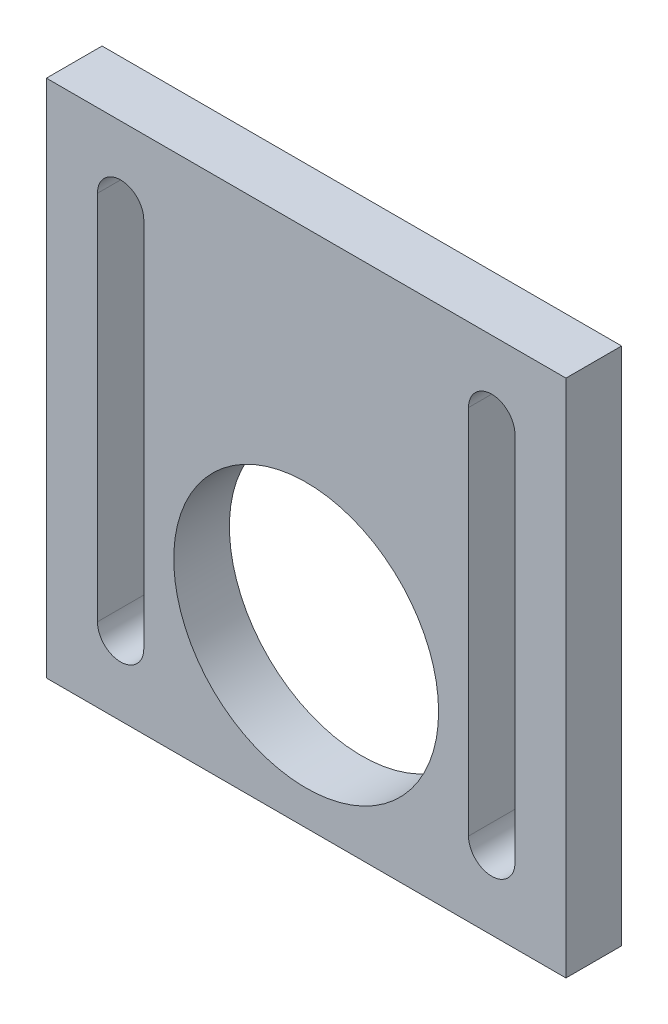
ISO-10303-21;
HEADER;
FILE_DESCRIPTION(('STEP AP214'),'2;1');
FILE_NAME('part.step','',(''),(''),'','','');
FILE_SCHEMA(('AUTOMOTIVE_DESIGN { 1 0 10303 214 1 1 1 1 }'));
ENDSEC;
DATA;
#1=APPLICATION_CONTEXT('core data for automotive mechanical design processes');
#2=APPLICATION_PROTOCOL_DEFINITION('international standard','automotive_design',2000,#1);
#3=PRODUCT_CONTEXT('',#1,'mechanical');
#4=PRODUCT('Part','Part','',(#3));
#5=PRODUCT_RELATED_PRODUCT_CATEGORY('part','',(#4));
#6=PRODUCT_DEFINITION_FORMATION('','',#4);
#7=PRODUCT_DEFINITION_CONTEXT('part definition',#1,'design');
#8=PRODUCT_DEFINITION('design','',#6,#7);
#9=PRODUCT_DEFINITION_SHAPE('','',#8);
#10=(LENGTH_UNIT() NAMED_UNIT(*) SI_UNIT(.MILLI.,.METRE.));
#11=(NAMED_UNIT(*) PLANE_ANGLE_UNIT() SI_UNIT($,.RADIAN.));
#12=(NAMED_UNIT(*) SI_UNIT($,.STERADIAN.) SOLID_ANGLE_UNIT());
#13=UNCERTAINTY_MEASURE_WITH_UNIT(LENGTH_MEASURE(1.E-05),#10,'distance_accuracy_value','');
#14=(GEOMETRIC_REPRESENTATION_CONTEXT(3) GLOBAL_UNCERTAINTY_ASSIGNED_CONTEXT((#13)) GLOBAL_UNIT_ASSIGNED_CONTEXT((#10,
#11,#12)) REPRESENTATION_CONTEXT('',''));
#15=CARTESIAN_POINT('',(0.,0.,0.));
#16=DIRECTION('',(0.,0.,1.));
#17=DIRECTION('',(1.,0.,0.));
#18=AXIS2_PLACEMENT_3D('',#15,#16,#17);
#19=CARTESIAN_POINT('',(0.,0.,6.));
#20=DIRECTION('',(-1.,0.,0.));
#21=DIRECTION('',(0.,0.,1.));
#22=AXIS2_PLACEMENT_3D('',#19,#20,#21);
#23=PLANE('',#22);
#24=DIRECTION('',(0.,1.,0.));
#25=VECTOR('',#24,1.);
#26=CARTESIAN_POINT('',(0.,0.,0.));
#27=LINE('',#26,#25);
#28=CARTESIAN_POINT('',(0.,0.,0.));
#29=VERTEX_POINT('',#28);
#30=CARTESIAN_POINT('',(0.,56.,0.));
#31=VERTEX_POINT('',#30);
#32=EDGE_CURVE('E196',#29,#31,#27,.T.);
#33=ORIENTED_EDGE('',*,*,#32,.F.);
#34=DIRECTION('',(0.,0.,-1.));
#35=VECTOR('',#34,1.);
#36=CARTESIAN_POINT('',(0.,0.,6.));
#37=LINE('',#36,#35);
#38=CARTESIAN_POINT('',(0.,0.,6.));
#39=VERTEX_POINT('',#38);
#40=EDGE_CURVE('E11',#39,#29,#37,.T.);
#41=ORIENTED_EDGE('',*,*,#40,.F.);
#42=DIRECTION('',(0.,1.,0.));
#43=VECTOR('',#42,1.);
#44=CARTESIAN_POINT('',(0.,0.,6.));
#45=LINE('',#44,#43);
#46=CARTESIAN_POINT('',(0.,56.,6.));
#47=VERTEX_POINT('',#46);
#48=EDGE_CURVE('E199',#39,#47,#45,.T.);
#49=ORIENTED_EDGE('',*,*,#48,.T.);
#50=DIRECTION('',(0.,0.,-1.));
#51=VECTOR('',#50,1.);
#52=CARTESIAN_POINT('',(0.,56.,6.));
#53=LINE('',#52,#51);
#54=EDGE_CURVE('E45',#47,#31,#53,.T.);
#55=ORIENTED_EDGE('',*,*,#54,.T.);
#56=EDGE_LOOP('',(#33,#41,#49,#55));
#57=FACE_BOUND('',#56,.T.);
#58=ADVANCED_FACE('F39',(#57),#23,.T.);
#59=CARTESIAN_POINT('',(0.,0.,6.));
#60=DIRECTION('',(0.,1.,0.));
#61=DIRECTION('',(0.,0.,1.));
#62=AXIS2_PLACEMENT_3D('',#59,#60,#61);
#63=PLANE('',#62);
#64=DIRECTION('',(1.,0.,0.));
#65=VECTOR('',#64,1.);
#66=CARTESIAN_POINT('',(0.,0.,0.));
#67=LINE('',#66,#65);
#68=CARTESIAN_POINT('',(56.,0.,0.));
#69=VERTEX_POINT('',#68);
#70=EDGE_CURVE('E204',#29,#69,#67,.T.);
#71=ORIENTED_EDGE('',*,*,#70,.T.);
#72=DIRECTION('',(0.,0.,-1.));
#73=VECTOR('',#72,1.);
#74=CARTESIAN_POINT('',(56.,0.,6.));
#75=LINE('',#74,#73);
#76=CARTESIAN_POINT('',(56.,0.,6.));
#77=VERTEX_POINT('',#76);
#78=EDGE_CURVE('E50',#77,#69,#75,.T.);
#79=ORIENTED_EDGE('',*,*,#78,.F.);
#80=DIRECTION('',(1.,0.,0.));
#81=VECTOR('',#80,1.);
#82=CARTESIAN_POINT('',(0.,0.,6.));
#83=LINE('',#82,#81);
#84=EDGE_CURVE('E207',#39,#77,#83,.T.);
#85=ORIENTED_EDGE('',*,*,#84,.F.);
#86=ORIENTED_EDGE('',*,*,#40,.T.);
#87=EDGE_LOOP('',(#71,#79,#85,#86));
#88=FACE_BOUND('',#87,.T.);
#89=ADVANCED_FACE('F237',(#88),#63,.F.);
#90=CARTESIAN_POINT('',(56.,0.,6.));
#91=DIRECTION('',(-1.,0.,0.));
#92=DIRECTION('',(0.,0.,1.));
#93=AXIS2_PLACEMENT_3D('',#90,#91,#92);
#94=PLANE('',#93);
#95=DIRECTION('',(0.,1.,0.));
#96=VECTOR('',#95,1.);
#97=CARTESIAN_POINT('',(56.,0.,0.));
#98=LINE('',#97,#96);
#99=CARTESIAN_POINT('',(56.,56.,0.));
#100=VERTEX_POINT('',#99);
#101=EDGE_CURVE('E216',#69,#100,#98,.T.);
#102=ORIENTED_EDGE('',*,*,#101,.T.);
#103=DIRECTION('',(0.,0.,-1.));
#104=VECTOR('',#103,1.);
#105=CARTESIAN_POINT('',(56.,56.,6.));
#106=LINE('',#105,#104);
#107=CARTESIAN_POINT('',(56.,56.,6.));
#108=VERTEX_POINT('',#107);
#109=EDGE_CURVE('E222',#108,#100,#106,.T.);
#110=ORIENTED_EDGE('',*,*,#109,.F.);
#111=DIRECTION('',(0.,1.,0.));
#112=VECTOR('',#111,1.);
#113=CARTESIAN_POINT('',(56.,0.,6.));
#114=LINE('',#113,#112);
#115=EDGE_CURVE('E210',#77,#108,#114,.T.);
#116=ORIENTED_EDGE('',*,*,#115,.F.);
#117=ORIENTED_EDGE('',*,*,#78,.T.);
#118=EDGE_LOOP('',(#102,#110,#116,#117));
#119=FACE_BOUND('',#118,.T.);
#120=ADVANCED_FACE('F238',(#119),#94,.F.);
#121=CARTESIAN_POINT('',(0.,56.,6.));
#122=DIRECTION('',(0.,1.,0.));
#123=DIRECTION('',(0.,0.,1.));
#124=AXIS2_PLACEMENT_3D('',#121,#122,#123);
#125=PLANE('',#124);
#126=DIRECTION('',(1.,0.,0.));
#127=VECTOR('',#126,1.);
#128=CARTESIAN_POINT('',(0.,56.,0.));
#129=LINE('',#128,#127);
#130=EDGE_CURVE('E213',#31,#100,#129,.T.);
#131=ORIENTED_EDGE('',*,*,#130,.F.);
#132=ORIENTED_EDGE('',*,*,#54,.F.);
#133=DIRECTION('',(1.,0.,0.));
#134=VECTOR('',#133,1.);
#135=CARTESIAN_POINT('',(0.,56.,6.));
#136=LINE('',#135,#134);
#137=EDGE_CURVE('E201',#47,#108,#136,.T.);
#138=ORIENTED_EDGE('',*,*,#137,.T.);
#139=ORIENTED_EDGE('',*,*,#109,.T.);
#140=EDGE_LOOP('',(#131,#132,#138,#139));
#141=FACE_BOUND('',#140,.T.);
#142=ADVANCED_FACE('F226',(#141),#125,.T.);
#143=CARTESIAN_POINT('',(0.,0.,6.));
#144=DIRECTION('',(0.,0.,-1.));
#145=DIRECTION('',(-1.,0.,0.));
#146=AXIS2_PLACEMENT_3D('',#143,#144,#145);
#147=PLANE('',#146);
#148=DIRECTION('',(0.,-1.,0.));
#149=VECTOR('',#148,1.);
#150=CARTESIAN_POINT('',(45.5,48.,6.));
#151=LINE('',#150,#149);
#152=CARTESIAN_POINT('',(45.5,48.,6.));
#153=VERTEX_POINT('',#152);
#154=CARTESIAN_POINT('',(45.5,8.,6.));
#155=VERTEX_POINT('',#154);
#156=EDGE_CURVE('E181',#153,#155,#151,.T.);
#157=ORIENTED_EDGE('',*,*,#156,.F.);
#158=CARTESIAN_POINT('',(48.,48.,6.));
#159=DIRECTION('',(0.,0.,1.));
#160=DIRECTION('',(1.,0.,0.));
#161=AXIS2_PLACEMENT_3D('',#158,#159,#160);
#162=CIRCLE('',#161,2.50000000000001);
#163=CARTESIAN_POINT('',(50.5,48.,6.));
#164=VERTEX_POINT('',#163);
#165=EDGE_CURVE('E54',#164,#153,#162,.T.);
#166=ORIENTED_EDGE('',*,*,#165,.F.);
#167=DIRECTION('',(0.,1.,0.));
#168=VECTOR('',#167,1.);
#169=CARTESIAN_POINT('',(50.5,48.,6.));
#170=LINE('',#169,#168);
#171=CARTESIAN_POINT('',(50.5,8.,6.));
#172=VERTEX_POINT('',#171);
#173=EDGE_CURVE('E176',#172,#164,#170,.T.);
#174=ORIENTED_EDGE('',*,*,#173,.F.);
#175=CARTESIAN_POINT('',(48.,8.,6.));
#176=DIRECTION('',(0.,0.,1.));
#177=DIRECTION('',(1.,0.,0.));
#178=AXIS2_PLACEMENT_3D('',#175,#176,#177);
#179=CIRCLE('',#178,2.50000000000001);
#180=EDGE_CURVE('E178',#155,#172,#179,.T.);
#181=ORIENTED_EDGE('',*,*,#180,.F.);
#182=EDGE_LOOP('',(#157,#166,#174,#181));
#183=FACE_BOUND('',#182,.T.);
#184=DIRECTION('',(0.,-1.,0.));
#185=VECTOR('',#184,1.);
#186=CARTESIAN_POINT('',(5.5,48.,6.));
#187=LINE('',#186,#185);
#188=CARTESIAN_POINT('',(5.5,48.,6.));
#189=VERTEX_POINT('',#188);
#190=CARTESIAN_POINT('',(5.5,8.,6.));
#191=VERTEX_POINT('',#190);
#192=EDGE_CURVE('E146',#189,#191,#187,.T.);
#193=ORIENTED_EDGE('',*,*,#192,.F.);
#194=CARTESIAN_POINT('',(8.,48.,6.));
#195=DIRECTION('',(0.,0.,1.));
#196=DIRECTION('',(1.,0.,0.));
#197=AXIS2_PLACEMENT_3D('',#194,#195,#196);
#198=CIRCLE('',#197,2.5);
#199=CARTESIAN_POINT('',(10.5,48.,6.));
#200=VERTEX_POINT('',#199);
#201=EDGE_CURVE('E65',#200,#189,#198,.T.);
#202=ORIENTED_EDGE('',*,*,#201,.F.);
#203=DIRECTION('',(0.,1.,0.));
#204=VECTOR('',#203,1.);
#205=CARTESIAN_POINT('',(10.5,48.,6.));
#206=LINE('',#205,#204);
#207=CARTESIAN_POINT('',(10.5,8.,6.));
#208=VERTEX_POINT('',#207);
#209=EDGE_CURVE('E137',#208,#200,#206,.T.);
#210=ORIENTED_EDGE('',*,*,#209,.F.);
#211=CARTESIAN_POINT('',(8.,8.,6.));
#212=DIRECTION('',(0.,0.,1.));
#213=DIRECTION('',(1.,0.,0.));
#214=AXIS2_PLACEMENT_3D('',#211,#212,#213);
#215=CIRCLE('',#214,2.5);
#216=EDGE_CURVE('E142',#191,#208,#215,.T.);
#217=ORIENTED_EDGE('',*,*,#216,.F.);
#218=EDGE_LOOP('',(#193,#202,#210,#217));
#219=FACE_BOUND('',#218,.T.);
#220=CARTESIAN_POINT('',(28.,18.,6.));
#221=DIRECTION('',(0.,0.,1.));
#222=DIRECTION('',(1.,0.,0.));
#223=AXIS2_PLACEMENT_3D('',#220,#221,#222);
#224=CIRCLE('',#223,14.275);
#225=CARTESIAN_POINT('',(42.275,18.,6.));
#226=VERTEX_POINT('',#225);
#227=EDGE_CURVE('E149',#226,#226,#224,.T.);
#228=ORIENTED_EDGE('',*,*,#227,.F.);
#229=EDGE_LOOP('',(#228));
#230=FACE_BOUND('',#229,.T.);
#231=ORIENTED_EDGE('',*,*,#48,.F.);
#232=ORIENTED_EDGE('',*,*,#84,.T.);
#233=ORIENTED_EDGE('',*,*,#115,.T.);
#234=ORIENTED_EDGE('',*,*,#137,.F.);
#235=EDGE_LOOP('',(#231,#232,#233,#234));
#236=FACE_BOUND('',#235,.T.);
#237=ADVANCED_FACE('F144',(#183,#219,#230,#236),#147,.F.);
#238=CARTESIAN_POINT('',(0.,0.,0.));
#239=DIRECTION('',(0.,0.,-1.));
#240=DIRECTION('',(-1.,0.,0.));
#241=AXIS2_PLACEMENT_3D('',#238,#239,#240);
#242=PLANE('',#241);
#243=CARTESIAN_POINT('',(48.,48.,0.));
#244=DIRECTION('',(0.,0.,1.));
#245=DIRECTION('',(1.,0.,0.));
#246=AXIS2_PLACEMENT_3D('',#243,#244,#245);
#247=CIRCLE('',#246,2.50000000000001);
#248=CARTESIAN_POINT('',(50.5,48.,0.));
#249=VERTEX_POINT('',#248);
#250=CARTESIAN_POINT('',(45.5,48.,0.));
#251=VERTEX_POINT('',#250);
#252=EDGE_CURVE('E180',#249,#251,#247,.T.);
#253=ORIENTED_EDGE('',*,*,#252,.T.);
#254=DIRECTION('',(0.,-1.,0.));
#255=VECTOR('',#254,1.);
#256=CARTESIAN_POINT('',(45.5,48.,0.));
#257=LINE('',#256,#255);
#258=CARTESIAN_POINT('',(45.5,8.,0.));
#259=VERTEX_POINT('',#258);
#260=EDGE_CURVE('E192',#251,#259,#257,.T.);
#261=ORIENTED_EDGE('',*,*,#260,.T.);
#262=CARTESIAN_POINT('',(48.,8.,0.));
#263=DIRECTION('',(0.,0.,1.));
#264=DIRECTION('',(1.,0.,0.));
#265=AXIS2_PLACEMENT_3D('',#262,#263,#264);
#266=CIRCLE('',#265,2.50000000000001);
#267=CARTESIAN_POINT('',(50.5,8.,0.));
#268=VERTEX_POINT('',#267);
#269=EDGE_CURVE('E186',#259,#268,#266,.T.);
#270=ORIENTED_EDGE('',*,*,#269,.T.);
#271=DIRECTION('',(0.,1.,0.));
#272=VECTOR('',#271,1.);
#273=CARTESIAN_POINT('',(50.5,48.,0.));
#274=LINE('',#273,#272);
#275=EDGE_CURVE('E166',#268,#249,#274,.T.);
#276=ORIENTED_EDGE('',*,*,#275,.T.);
#277=EDGE_LOOP('',(#253,#261,#270,#276));
#278=FACE_BOUND('',#277,.T.);
#279=CARTESIAN_POINT('',(8.,48.,0.));
#280=DIRECTION('',(0.,0.,1.));
#281=DIRECTION('',(1.,0.,0.));
#282=AXIS2_PLACEMENT_3D('',#279,#280,#281);
#283=CIRCLE('',#282,2.5);
#284=CARTESIAN_POINT('',(10.5,48.,0.));
#285=VERTEX_POINT('',#284);
#286=CARTESIAN_POINT('',(5.5,48.,0.));
#287=VERTEX_POINT('',#286);
#288=EDGE_CURVE('E128',#285,#287,#283,.T.);
#289=ORIENTED_EDGE('',*,*,#288,.T.);
#290=DIRECTION('',(0.,-1.,0.));
#291=VECTOR('',#290,1.);
#292=CARTESIAN_POINT('',(5.5,48.,0.));
#293=LINE('',#292,#291);
#294=CARTESIAN_POINT('',(5.5,8.,0.));
#295=VERTEX_POINT('',#294);
#296=EDGE_CURVE('E162',#287,#295,#293,.T.);
#297=ORIENTED_EDGE('',*,*,#296,.T.);
#298=CARTESIAN_POINT('',(8.,8.,0.));
#299=DIRECTION('',(0.,0.,1.));
#300=DIRECTION('',(1.,0.,0.));
#301=AXIS2_PLACEMENT_3D('',#298,#299,#300);
#302=CIRCLE('',#301,2.5);
#303=CARTESIAN_POINT('',(10.5,8.,0.));
#304=VERTEX_POINT('',#303);
#305=EDGE_CURVE('E157',#295,#304,#302,.T.);
#306=ORIENTED_EDGE('',*,*,#305,.T.);
#307=DIRECTION('',(0.,1.,0.));
#308=VECTOR('',#307,1.);
#309=CARTESIAN_POINT('',(10.5,48.,0.));
#310=LINE('',#309,#308);
#311=EDGE_CURVE('E160',#304,#285,#310,.T.);
#312=ORIENTED_EDGE('',*,*,#311,.T.);
#313=EDGE_LOOP('',(#289,#297,#306,#312));
#314=FACE_BOUND('',#313,.T.);
#315=CARTESIAN_POINT('',(28.,18.,0.));
#316=DIRECTION('',(0.,0.,1.));
#317=DIRECTION('',(1.,0.,0.));
#318=AXIS2_PLACEMENT_3D('',#315,#316,#317);
#319=CIRCLE('',#318,14.275);
#320=CARTESIAN_POINT('',(42.275,18.,0.));
#321=VERTEX_POINT('',#320);
#322=EDGE_CURVE('E155',#321,#321,#319,.T.);
#323=ORIENTED_EDGE('',*,*,#322,.T.);
#324=EDGE_LOOP('',(#323));
#325=FACE_BOUND('',#324,.T.);
#326=ORIENTED_EDGE('',*,*,#32,.T.);
#327=ORIENTED_EDGE('',*,*,#130,.T.);
#328=ORIENTED_EDGE('',*,*,#101,.F.);
#329=ORIENTED_EDGE('',*,*,#70,.F.);
#330=EDGE_LOOP('',(#326,#327,#328,#329));
#331=FACE_BOUND('',#330,.T.);
#332=ADVANCED_FACE('F234',(#278,#314,#325,#331),#242,.T.);
#333=CARTESIAN_POINT('',(28.,18.,0.));
#334=DIRECTION('',(0.,0.,1.));
#335=DIRECTION('',(1.,0.,0.));
#336=AXIS2_PLACEMENT_3D('',#333,#334,#335);
#337=CYLINDRICAL_SURFACE('',#336,14.275);
#338=ORIENTED_EDGE('',*,*,#322,.F.);
#339=EDGE_LOOP('',(#338));
#340=FACE_BOUND('',#339,.T.);
#341=ORIENTED_EDGE('',*,*,#227,.T.);
#342=EDGE_LOOP('',(#341));
#343=FACE_BOUND('',#342,.T.);
#344=ADVANCED_FACE('F248',(#340,#343),#337,.F.);
#345=CARTESIAN_POINT('',(8.,48.,0.));
#346=DIRECTION('',(0.,0.,1.));
#347=DIRECTION('',(1.,0.,0.));
#348=AXIS2_PLACEMENT_3D('',#345,#346,#347);
#349=CYLINDRICAL_SURFACE('',#348,2.5);
#350=ORIENTED_EDGE('',*,*,#201,.T.);
#351=DIRECTION('',(0.,0.,1.));
#352=VECTOR('',#351,1.);
#353=CARTESIAN_POINT('',(5.5,48.,0.));
#354=LINE('',#353,#352);
#355=EDGE_CURVE('E159',#287,#189,#354,.T.);
#356=ORIENTED_EDGE('',*,*,#355,.F.);
#357=ORIENTED_EDGE('',*,*,#288,.F.);
#358=DIRECTION('',(0.,0.,1.));
#359=VECTOR('',#358,1.);
#360=CARTESIAN_POINT('',(10.5,48.,0.));
#361=LINE('',#360,#359);
#362=EDGE_CURVE('E127',#285,#200,#361,.T.);
#363=ORIENTED_EDGE('',*,*,#362,.T.);
#364=EDGE_LOOP('',(#350,#356,#357,#363));
#365=FACE_BOUND('',#364,.T.);
#366=ADVANCED_FACE('F126',(#365),#349,.F.);
#367=CARTESIAN_POINT('',(10.5,48.,0.));
#368=DIRECTION('',(1.,0.,0.));
#369=DIRECTION('',(0.,1.,0.));
#370=AXIS2_PLACEMENT_3D('',#367,#368,#369);
#371=PLANE('',#370);
#372=ORIENTED_EDGE('',*,*,#209,.T.);
#373=ORIENTED_EDGE('',*,*,#362,.F.);
#374=ORIENTED_EDGE('',*,*,#311,.F.);
#375=DIRECTION('',(0.,0.,1.));
#376=VECTOR('',#375,1.);
#377=CARTESIAN_POINT('',(10.5,8.,0.));
#378=LINE('',#377,#376);
#379=EDGE_CURVE('E131',#304,#208,#378,.T.);
#380=ORIENTED_EDGE('',*,*,#379,.T.);
#381=EDGE_LOOP('',(#372,#373,#374,#380));
#382=FACE_BOUND('',#381,.T.);
#383=ADVANCED_FACE('F139',(#382),#371,.F.);
#384=CARTESIAN_POINT('',(8.,8.,0.));
#385=DIRECTION('',(0.,0.,1.));
#386=DIRECTION('',(1.,0.,0.));
#387=AXIS2_PLACEMENT_3D('',#384,#385,#386);
#388=CYLINDRICAL_SURFACE('',#387,2.5);
#389=ORIENTED_EDGE('',*,*,#216,.T.);
#390=ORIENTED_EDGE('',*,*,#379,.F.);
#391=ORIENTED_EDGE('',*,*,#305,.F.);
#392=DIRECTION('',(0.,0.,1.));
#393=VECTOR('',#392,1.);
#394=CARTESIAN_POINT('',(5.5,8.,0.));
#395=LINE('',#394,#393);
#396=EDGE_CURVE('E379',#295,#191,#395,.T.);
#397=ORIENTED_EDGE('',*,*,#396,.T.);
#398=EDGE_LOOP('',(#389,#390,#391,#397));
#399=FACE_BOUND('',#398,.T.);
#400=ADVANCED_FACE('F308',(#399),#388,.F.);
#401=CARTESIAN_POINT('',(5.5,48.,0.));
#402=DIRECTION('',(-1.,0.,0.));
#403=DIRECTION('',(0.,-1.,0.));
#404=AXIS2_PLACEMENT_3D('',#401,#402,#403);
#405=PLANE('',#404);
#406=ORIENTED_EDGE('',*,*,#192,.T.);
#407=ORIENTED_EDGE('',*,*,#396,.F.);
#408=ORIENTED_EDGE('',*,*,#296,.F.);
#409=ORIENTED_EDGE('',*,*,#355,.T.);
#410=EDGE_LOOP('',(#406,#407,#408,#409));
#411=FACE_BOUND('',#410,.T.);
#412=ADVANCED_FACE('F312',(#411),#405,.F.);
#413=CARTESIAN_POINT('',(48.,48.,0.));
#414=DIRECTION('',(0.,0.,1.));
#415=DIRECTION('',(1.,0.,0.));
#416=AXIS2_PLACEMENT_3D('',#413,#414,#415);
#417=CYLINDRICAL_SURFACE('',#416,2.50000000000001);
#418=ORIENTED_EDGE('',*,*,#165,.T.);
#419=DIRECTION('',(0.,0.,1.));
#420=VECTOR('',#419,1.);
#421=CARTESIAN_POINT('',(45.5,48.,0.));
#422=LINE('',#421,#420);
#423=EDGE_CURVE('E170',#251,#153,#422,.T.);
#424=ORIENTED_EDGE('',*,*,#423,.F.);
#425=ORIENTED_EDGE('',*,*,#252,.F.);
#426=DIRECTION('',(0.,0.,1.));
#427=VECTOR('',#426,1.);
#428=CARTESIAN_POINT('',(50.5,48.,0.));
#429=LINE('',#428,#427);
#430=EDGE_CURVE('E171',#249,#164,#429,.T.);
#431=ORIENTED_EDGE('',*,*,#430,.T.);
#432=EDGE_LOOP('',(#418,#424,#425,#431));
#433=FACE_BOUND('',#432,.T.);
#434=ADVANCED_FACE('F324',(#433),#417,.F.);
#435=CARTESIAN_POINT('',(50.5,48.,0.));
#436=DIRECTION('',(1.,0.,0.));
#437=DIRECTION('',(0.,0.,-1.));
#438=AXIS2_PLACEMENT_3D('',#435,#436,#437);
#439=PLANE('',#438);
#440=ORIENTED_EDGE('',*,*,#173,.T.);
#441=ORIENTED_EDGE('',*,*,#430,.F.);
#442=ORIENTED_EDGE('',*,*,#275,.F.);
#443=DIRECTION('',(0.,0.,1.));
#444=VECTOR('',#443,1.);
#445=CARTESIAN_POINT('',(50.5,8.,0.));
#446=LINE('',#445,#444);
#447=EDGE_CURVE('E174',#268,#172,#446,.T.);
#448=ORIENTED_EDGE('',*,*,#447,.T.);
#449=EDGE_LOOP('',(#440,#441,#442,#448));
#450=FACE_BOUND('',#449,.T.);
#451=ADVANCED_FACE('F333',(#450),#439,.F.);
#452=CARTESIAN_POINT('',(48.,8.,0.));
#453=DIRECTION('',(0.,0.,1.));
#454=DIRECTION('',(1.,0.,0.));
#455=AXIS2_PLACEMENT_3D('',#452,#453,#454);
#456=CYLINDRICAL_SURFACE('',#455,2.50000000000001);
#457=ORIENTED_EDGE('',*,*,#180,.T.);
#458=ORIENTED_EDGE('',*,*,#447,.F.);
#459=ORIENTED_EDGE('',*,*,#269,.F.);
#460=DIRECTION('',(0.,0.,1.));
#461=VECTOR('',#460,1.);
#462=CARTESIAN_POINT('',(45.5,8.,0.));
#463=LINE('',#462,#461);
#464=EDGE_CURVE('E168',#259,#155,#463,.T.);
#465=ORIENTED_EDGE('',*,*,#464,.T.);
#466=EDGE_LOOP('',(#457,#458,#459,#465));
#467=FACE_BOUND('',#466,.T.);
#468=ADVANCED_FACE('F343',(#467),#456,.F.);
#469=CARTESIAN_POINT('',(45.5,48.,0.));
#470=DIRECTION('',(-1.,0.,0.));
#471=DIRECTION('',(0.,0.,1.));
#472=AXIS2_PLACEMENT_3D('',#469,#470,#471);
#473=PLANE('',#472);
#474=ORIENTED_EDGE('',*,*,#156,.T.);
#475=ORIENTED_EDGE('',*,*,#464,.F.);
#476=ORIENTED_EDGE('',*,*,#260,.F.);
#477=ORIENTED_EDGE('',*,*,#423,.T.);
#478=EDGE_LOOP('',(#474,#475,#476,#477));
#479=FACE_BOUND('',#478,.T.);
#480=ADVANCED_FACE('F351',(#479),#473,.F.);
#481=CLOSED_SHELL('',(#58,#89,#120,#142,#237,#332,#344,#366,#383,#400,#412,#434,#451,#468,#480));
#482=MANIFOLD_SOLID_BREP('B2',#481);
#483=ADVANCED_BREP_SHAPE_REPRESENTATION('',(#18,#482),#14);
#484=SHAPE_DEFINITION_REPRESENTATION(#9,#483);
ENDSEC;
END-ISO-10303-21;
